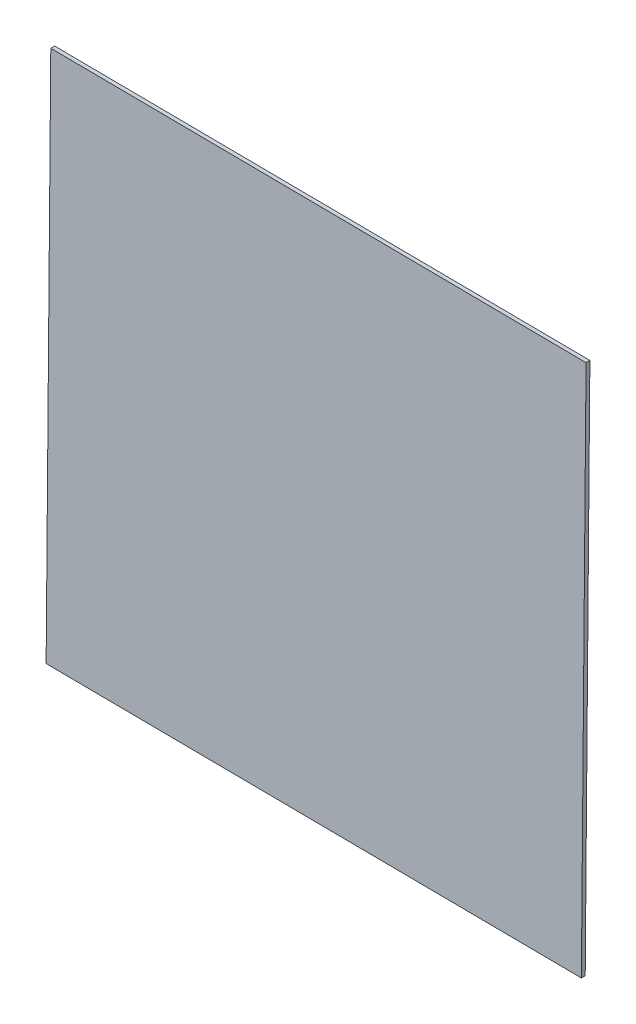
ISO-10303-21;
HEADER;
FILE_DESCRIPTION(('STEP AP214'),'2;1');
FILE_NAME('part.step','',(''),(''),'','','');
FILE_SCHEMA(('AUTOMOTIVE_DESIGN { 1 0 10303 214 1 1 1 1 }'));
ENDSEC;
DATA;
#1=APPLICATION_CONTEXT('core data for automotive mechanical design processes');
#2=APPLICATION_PROTOCOL_DEFINITION('international standard','automotive_design',2000,#1);
#3=PRODUCT_CONTEXT('',#1,'mechanical');
#4=PRODUCT('Part','Part','',(#3));
#5=PRODUCT_RELATED_PRODUCT_CATEGORY('part','',(#4));
#6=PRODUCT_DEFINITION_FORMATION('','',#4);
#7=PRODUCT_DEFINITION_CONTEXT('part definition',#1,'design');
#8=PRODUCT_DEFINITION('design','',#6,#7);
#9=PRODUCT_DEFINITION_SHAPE('','',#8);
#10=(LENGTH_UNIT() NAMED_UNIT(*) SI_UNIT(.MILLI.,.METRE.));
#11=(NAMED_UNIT(*) PLANE_ANGLE_UNIT() SI_UNIT($,.RADIAN.));
#12=(NAMED_UNIT(*) SI_UNIT($,.STERADIAN.) SOLID_ANGLE_UNIT());
#13=UNCERTAINTY_MEASURE_WITH_UNIT(LENGTH_MEASURE(1.E-05),#10,'distance_accuracy_value','');
#14=(GEOMETRIC_REPRESENTATION_CONTEXT(3) GLOBAL_UNCERTAINTY_ASSIGNED_CONTEXT((#13)) GLOBAL_UNIT_ASSIGNED_CONTEXT((#10,
#11,#12)) REPRESENTATION_CONTEXT('',''));
#15=CARTESIAN_POINT('',(0.,0.,0.));
#16=DIRECTION('',(0.,0.,1.));
#17=DIRECTION('',(1.,0.,0.));
#18=AXIS2_PLACEMENT_3D('',#15,#16,#17);
#19=CARTESIAN_POINT('',(-79.8313802902276,73.8109052166158,0.126999999999988));
#20=DIRECTION('',(-0.00872653549836423,-0.999961923064171,0.));
#21=DIRECTION('',(0.999961923064172,-0.00872653549836417,0.));
#22=AXIS2_PLACEMENT_3D('',#19,#20,#21);
#23=PLANE('',#22);
#24=DIRECTION('',(-0.999961923064171,0.00872653549836417,0.));
#25=VECTOR('',#24,1.);
#26=CARTESIAN_POINT('',(-79.8313802902276,73.8109052166158,0.));
#27=LINE('',#26,#25);
#28=CARTESIAN_POINT('',(-79.8313802902276,73.8109052166158,0.));
#29=VERTEX_POINT('',#28);
#30=CARTESIAN_POINT('',(-97.5599052166167,73.9656197097642,1.24344978758018E-11));
#31=VERTEX_POINT('',#30);
#32=EDGE_CURVE('E98',#29,#31,#27,.T.);
#33=ORIENTED_EDGE('',*,*,#32,.T.);
#34=DIRECTION('',(0.,0.,-1.00000000000001));
#35=VECTOR('',#34,1.);
#36=CARTESIAN_POINT('',(-97.5599052166167,73.9656197097678,0.127000000015087));
#37=LINE('',#36,#35);
#38=CARTESIAN_POINT('',(-97.5599052166167,73.9656197097678,0.127000000015087));
#39=VERTEX_POINT('',#38);
#40=EDGE_CURVE('E11',#39,#31,#37,.T.);
#41=ORIENTED_EDGE('',*,*,#40,.F.);
#42=DIRECTION('',(-0.999961923064171,0.00872653549836417,0.));
#43=VECTOR('',#42,1.);
#44=CARTESIAN_POINT('',(-79.8313802902276,73.8109052166158,0.126999999999988));
#45=LINE('',#44,#43);
#46=CARTESIAN_POINT('',(-79.8313802902276,73.8109052166158,0.126999999999988));
#47=VERTEX_POINT('',#46);
#48=EDGE_CURVE('E86',#47,#39,#45,.T.);
#49=ORIENTED_EDGE('',*,*,#48,.F.);
#50=DIRECTION('',(0.,0.,-1.00000000000001));
#51=VECTOR('',#50,1.);
#52=CARTESIAN_POINT('',(-79.8313802902276,73.8109052166158,0.126999999999988));
#53=LINE('',#52,#51);
#54=EDGE_CURVE('E94',#47,#29,#53,.T.);
#55=ORIENTED_EDGE('',*,*,#54,.T.);
#56=EDGE_LOOP('',(#33,#41,#49,#55));
#57=FACE_BOUND('',#56,.T.);
#58=ADVANCED_FACE('F35',(#57),#23,.F.);
#59=CARTESIAN_POINT('',(-97.5599052166167,73.9656197097678,0.127000000015087));
#60=DIRECTION('',(0.999961923064171,-0.00872653549836573,0.));
#61=DIRECTION('',(0.00872653549836581,0.999961923064171,0.));
#62=AXIS2_PLACEMENT_3D('',#59,#60,#61);
#63=PLANE('',#62);
#64=DIRECTION('',(-0.00872653549836581,-0.999961923064171,0.));
#65=VECTOR('',#64,1.);
#66=CARTESIAN_POINT('',(-97.5599052166167,73.9656197097642,1.24344978758018E-11));
#67=LINE('',#66,#65);
#68=CARTESIAN_POINT('',(-97.7146197097743,56.237094783381,3.5527136788005E-12));
#69=VERTEX_POINT('',#68);
#70=EDGE_CURVE('E90',#31,#69,#67,.T.);
#71=ORIENTED_EDGE('',*,*,#70,.T.);
#72=DIRECTION('',(0.,0.,-1.00000000000001));
#73=VECTOR('',#72,1.);
#74=CARTESIAN_POINT('',(-97.7146197097747,56.2370947833828,0.127000000005317));
#75=LINE('',#74,#73);
#76=CARTESIAN_POINT('',(-97.7146197097747,56.2370947833828,0.127000000005317));
#77=VERTEX_POINT('',#76);
#78=EDGE_CURVE('E43',#77,#69,#75,.T.);
#79=ORIENTED_EDGE('',*,*,#78,.F.);
#80=DIRECTION('',(-0.00872653549836581,-0.999961923064171,0.));
#81=VECTOR('',#80,1.);
#82=CARTESIAN_POINT('',(-97.5599052166167,73.9656197097678,0.127000000015087));
#83=LINE('',#82,#81);
#84=EDGE_CURVE('E81',#39,#77,#83,.T.);
#85=ORIENTED_EDGE('',*,*,#84,.F.);
#86=ORIENTED_EDGE('',*,*,#40,.T.);
#87=EDGE_LOOP('',(#71,#79,#85,#86));
#88=FACE_BOUND('',#87,.T.);
#89=ADVANCED_FACE('F89',(#88),#63,.F.);
#90=CARTESIAN_POINT('',(-97.7146197097747,56.2370947833828,0.127000000005317));
#91=DIRECTION('',(0.00872653549837131,0.999961923064172,0.));
#92=DIRECTION('',(-0.999961923064176,0.00872653549837128,0.));
#93=AXIS2_PLACEMENT_3D('',#90,#91,#92);
#94=PLANE('',#93);
#95=DIRECTION('',(0.999961923064175,-0.00872653549837128,0.));
#96=VECTOR('',#95,1.);
#97=CARTESIAN_POINT('',(-97.7146197097743,56.237094783381,3.5527136788005E-12));
#98=LINE('',#97,#96);
#99=CARTESIAN_POINT('',(-79.9860947833856,56.0823802902237,5.32907051820075E-12));
#100=VERTEX_POINT('',#99);
#101=EDGE_CURVE('E68',#69,#100,#98,.T.);
#102=ORIENTED_EDGE('',*,*,#101,.T.);
#103=DIRECTION('',(0.,0.,-1.00000000000001));
#104=VECTOR('',#103,1.);
#105=CARTESIAN_POINT('',(-79.9860947833858,56.0823802902264,0.127000000004429));
#106=LINE('',#105,#104);
#107=CARTESIAN_POINT('',(-79.9860947833858,56.0823802902264,0.127000000004429));
#108=VERTEX_POINT('',#107);
#109=EDGE_CURVE('E91',#108,#100,#106,.T.);
#110=ORIENTED_EDGE('',*,*,#109,.F.);
#111=DIRECTION('',(0.999961923064175,-0.00872653549837128,0.));
#112=VECTOR('',#111,1.);
#113=CARTESIAN_POINT('',(-97.7146197097747,56.2370947833828,0.127000000005317));
#114=LINE('',#113,#112);
#115=EDGE_CURVE('E84',#77,#108,#114,.T.);
#116=ORIENTED_EDGE('',*,*,#115,.F.);
#117=ORIENTED_EDGE('',*,*,#78,.T.);
#118=EDGE_LOOP('',(#102,#110,#116,#117));
#119=FACE_BOUND('',#118,.T.);
#120=ADVANCED_FACE('F92',(#119),#94,.F.);
#121=CARTESIAN_POINT('',(-79.9860947833858,56.0823802902264,0.127000000004429));
#122=DIRECTION('',(-0.999961923064176,0.00872653549836727,0.));
#123=DIRECTION('',(-0.00872653549836735,-0.999961923064176,0.));
#124=AXIS2_PLACEMENT_3D('',#121,#122,#123);
#125=PLANE('',#124);
#126=DIRECTION('',(0.00872653549836735,0.999961923064176,0.));
#127=VECTOR('',#126,1.);
#128=CARTESIAN_POINT('',(-79.9860947833856,56.0823802902237,5.32907051820075E-12));
#129=LINE('',#128,#127);
#130=EDGE_CURVE('E74',#100,#29,#129,.T.);
#131=ORIENTED_EDGE('',*,*,#130,.T.);
#132=ORIENTED_EDGE('',*,*,#54,.F.);
#133=DIRECTION('',(0.00872653549836735,0.999961923064176,0.));
#134=VECTOR('',#133,1.);
#135=CARTESIAN_POINT('',(-79.9860947833858,56.0823802902264,0.127000000004429));
#136=LINE('',#135,#134);
#137=EDGE_CURVE('E51',#108,#47,#136,.T.);
#138=ORIENTED_EDGE('',*,*,#137,.F.);
#139=ORIENTED_EDGE('',*,*,#109,.T.);
#140=EDGE_LOOP('',(#131,#132,#138,#139));
#141=FACE_BOUND('',#140,.T.);
#142=ADVANCED_FACE('F105',(#141),#125,.F.);
#143=CARTESIAN_POINT('',(0.,-4.44089209850063E-13,0.127000000015975));
#144=DIRECTION('',(0.,0.,1.00000000000001));
#145=DIRECTION('',(1.,0.,0.));
#146=AXIS2_PLACEMENT_3D('',#143,#144,#145);
#147=PLANE('',#146);
#148=ORIENTED_EDGE('',*,*,#48,.T.);
#149=ORIENTED_EDGE('',*,*,#84,.T.);
#150=ORIENTED_EDGE('',*,*,#115,.T.);
#151=ORIENTED_EDGE('',*,*,#137,.T.);
#152=EDGE_LOOP('',(#148,#149,#150,#151));
#153=FACE_BOUND('',#152,.T.);
#154=ADVANCED_FACE('F82',(#153),#147,.T.);
#155=CARTESIAN_POINT('',(0.,0.,0.));
#156=DIRECTION('',(0.,0.,1.00000000000001));
#157=DIRECTION('',(1.,0.,0.));
#158=AXIS2_PLACEMENT_3D('',#155,#156,#157);
#159=PLANE('',#158);
#160=ORIENTED_EDGE('',*,*,#32,.F.);
#161=ORIENTED_EDGE('',*,*,#130,.F.);
#162=ORIENTED_EDGE('',*,*,#101,.F.);
#163=ORIENTED_EDGE('',*,*,#70,.F.);
#164=EDGE_LOOP('',(#160,#161,#162,#163));
#165=FACE_BOUND('',#164,.T.);
#166=ADVANCED_FACE('F108',(#165),#159,.F.);
#167=CLOSED_SHELL('',(#58,#89,#120,#142,#154,#166));
#168=MANIFOLD_SOLID_BREP('B2',#167);
#169=ADVANCED_BREP_SHAPE_REPRESENTATION('',(#18,#168),#14);
#170=SHAPE_DEFINITION_REPRESENTATION(#9,#169);
ENDSEC;
END-ISO-10303-21;
